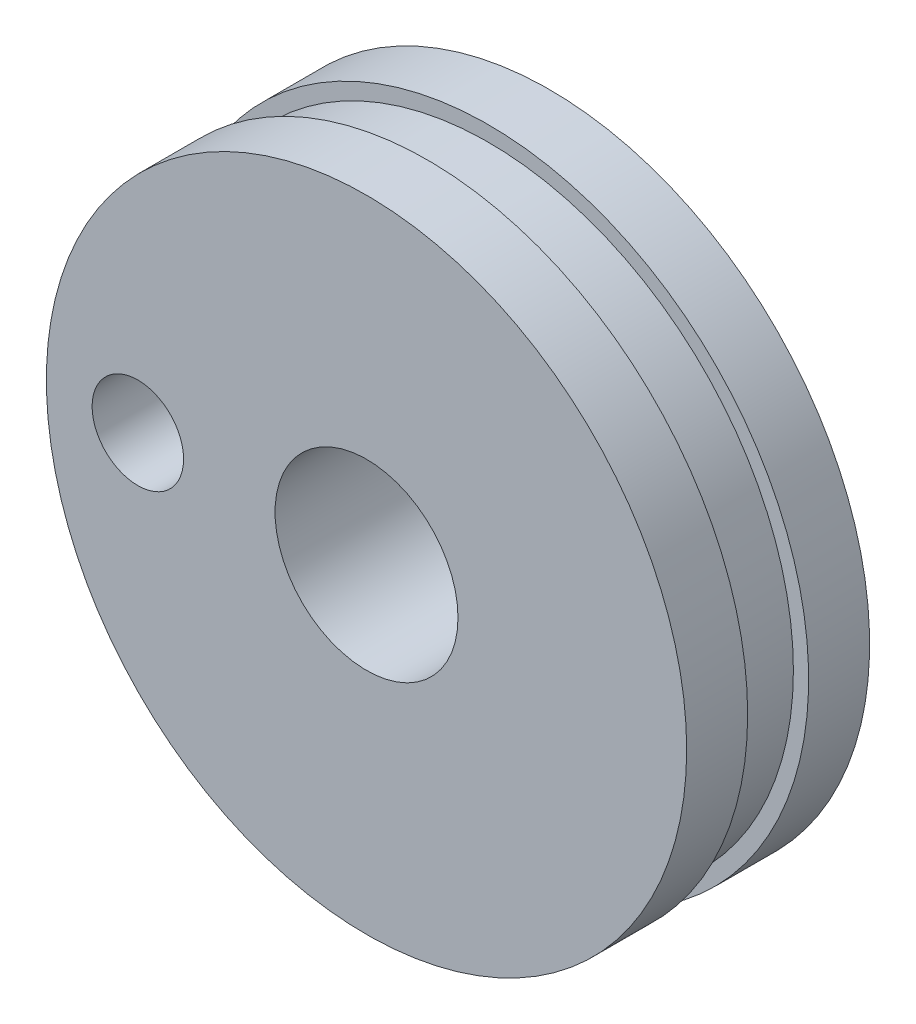
ISO-10303-21;
HEADER;
FILE_DESCRIPTION(('STEP AP214'),'2;1');
FILE_NAME('part.step','',(''),(''),'','','');
FILE_SCHEMA(('AUTOMOTIVE_DESIGN { 1 0 10303 214 1 1 1 1 }'));
ENDSEC;
DATA;
#1=APPLICATION_CONTEXT('core data for automotive mechanical design processes');
#2=APPLICATION_PROTOCOL_DEFINITION('international standard','automotive_design',2000,#1);
#3=PRODUCT_CONTEXT('',#1,'mechanical');
#4=PRODUCT('Part','Part','',(#3));
#5=PRODUCT_RELATED_PRODUCT_CATEGORY('part','',(#4));
#6=PRODUCT_DEFINITION_FORMATION('','',#4);
#7=PRODUCT_DEFINITION_CONTEXT('part definition',#1,'design');
#8=PRODUCT_DEFINITION('design','',#6,#7);
#9=PRODUCT_DEFINITION_SHAPE('','',#8);
#10=(LENGTH_UNIT() NAMED_UNIT(*) SI_UNIT(.MILLI.,.METRE.));
#11=(NAMED_UNIT(*) PLANE_ANGLE_UNIT() SI_UNIT($,.RADIAN.));
#12=(NAMED_UNIT(*) SI_UNIT($,.STERADIAN.) SOLID_ANGLE_UNIT());
#13=UNCERTAINTY_MEASURE_WITH_UNIT(LENGTH_MEASURE(1.E-05),#10,'distance_accuracy_value','');
#14=(GEOMETRIC_REPRESENTATION_CONTEXT(3) GLOBAL_UNCERTAINTY_ASSIGNED_CONTEXT((#13)) GLOBAL_UNIT_ASSIGNED_CONTEXT((#10,
#11,#12)) REPRESENTATION_CONTEXT('',''));
#15=CARTESIAN_POINT('',(0.,0.,0.));
#16=DIRECTION('',(0.,0.,1.));
#17=DIRECTION('',(1.,0.,0.));
#18=AXIS2_PLACEMENT_3D('',#15,#16,#17);
#19=CARTESIAN_POINT('',(0.,0.,14.));
#20=DIRECTION('',(0.,0.,-1.));
#21=DIRECTION('',(-1.,0.,0.));
#22=AXIS2_PLACEMENT_3D('',#19,#20,#21);
#23=CYLINDRICAL_SURFACE('',#22,73.5);
#24=CARTESIAN_POINT('',(0.,0.,14.));
#25=DIRECTION('',(0.,0.,1.));
#26=DIRECTION('',(1.,0.,0.));
#27=AXIS2_PLACEMENT_3D('',#24,#25,#26);
#28=CIRCLE('',#27,73.5);
#29=CARTESIAN_POINT('',(73.5,0.,14.));
#30=VERTEX_POINT('',#29);
#31=EDGE_CURVE('E10',#30,#30,#28,.T.);
#32=ORIENTED_EDGE('',*,*,#31,.F.);
#33=EDGE_LOOP('',(#32));
#34=FACE_BOUND('',#33,.T.);
#35=CARTESIAN_POINT('',(0.,0.,0.));
#36=DIRECTION('',(0.,0.,1.));
#37=DIRECTION('',(1.,0.,0.));
#38=AXIS2_PLACEMENT_3D('',#35,#36,#37);
#39=CIRCLE('',#38,73.5);
#40=CARTESIAN_POINT('',(73.5,0.,0.));
#41=VERTEX_POINT('',#40);
#42=EDGE_CURVE('E45',#41,#41,#39,.T.);
#43=ORIENTED_EDGE('',*,*,#42,.T.);
#44=EDGE_LOOP('',(#43));
#45=FACE_BOUND('',#44,.T.);
#46=ADVANCED_FACE('F37',(#34,#45),#23,.T.);
#47=CARTESIAN_POINT('',(0.,0.,14.));
#48=DIRECTION('',(0.,0.,1.));
#49=DIRECTION('',(1.,0.,0.));
#50=AXIS2_PLACEMENT_3D('',#47,#48,#49);
#51=PLANE('',#50);
#52=CARTESIAN_POINT('',(-52.5,0.,14.));
#53=DIRECTION('',(0.,0.,1.));
#54=DIRECTION('',(1.,0.,0.));
#55=AXIS2_PLACEMENT_3D('',#52,#53,#54);
#56=CIRCLE('',#55,10.5);
#57=CARTESIAN_POINT('',(-42.,0.,14.));
#58=VERTEX_POINT('',#57);
#59=EDGE_CURVE('E72',#58,#58,#56,.T.);
#60=ORIENTED_EDGE('',*,*,#59,.F.);
#61=EDGE_LOOP('',(#60));
#62=FACE_BOUND('',#61,.T.);
#63=CARTESIAN_POINT('',(0.,0.,14.));
#64=DIRECTION('',(0.,0.,1.));
#65=DIRECTION('',(1.,0.,0.));
#66=AXIS2_PLACEMENT_3D('',#63,#64,#65);
#67=CIRCLE('',#66,21.);
#68=CARTESIAN_POINT('',(21.,0.,14.));
#69=VERTEX_POINT('',#68);
#70=EDGE_CURVE('E68',#69,#69,#67,.T.);
#71=ORIENTED_EDGE('',*,*,#70,.F.);
#72=EDGE_LOOP('',(#71));
#73=FACE_BOUND('',#72,.T.);
#74=ORIENTED_EDGE('',*,*,#31,.T.);
#75=EDGE_LOOP('',(#74));
#76=FACE_BOUND('',#75,.T.);
#77=ADVANCED_FACE('F111',(#62,#73,#76),#51,.T.);
#78=CARTESIAN_POINT('',(0.,0.,0.));
#79=DIRECTION('',(0.,0.,1.));
#80=DIRECTION('',(1.,0.,0.));
#81=AXIS2_PLACEMENT_3D('',#78,#79,#80);
#82=PLANE('',#81);
#83=CARTESIAN_POINT('',(0.,0.,0.));
#84=DIRECTION('',(0.,0.,1.));
#85=DIRECTION('',(1.,0.,0.));
#86=AXIS2_PLACEMENT_3D('',#83,#84,#85);
#87=CIRCLE('',#86,70.);
#88=CARTESIAN_POINT('',(70.,0.,0.));
#89=VERTEX_POINT('',#88);
#90=EDGE_CURVE('E51',#89,#89,#87,.T.);
#91=ORIENTED_EDGE('',*,*,#90,.T.);
#92=EDGE_LOOP('',(#91));
#93=FACE_BOUND('',#92,.T.);
#94=ORIENTED_EDGE('',*,*,#42,.F.);
#95=EDGE_LOOP('',(#94));
#96=FACE_BOUND('',#95,.T.);
#97=ADVANCED_FACE('F116',(#93,#96),#82,.F.);
#98=CARTESIAN_POINT('',(0.,0.,-14.));
#99=DIRECTION('',(0.,0.,1.));
#100=DIRECTION('',(1.,0.,0.));
#101=AXIS2_PLACEMENT_3D('',#98,#99,#100);
#102=CYLINDRICAL_SURFACE('',#101,70.);
#103=CARTESIAN_POINT('',(0.,0.,-14.));
#104=DIRECTION('',(0.,0.,1.));
#105=DIRECTION('',(1.,0.,0.));
#106=AXIS2_PLACEMENT_3D('',#103,#104,#105);
#107=CIRCLE('',#106,70.);
#108=CARTESIAN_POINT('',(70.,0.,-14.));
#109=VERTEX_POINT('',#108);
#110=EDGE_CURVE('E56',#109,#109,#107,.T.);
#111=ORIENTED_EDGE('',*,*,#110,.T.);
#112=EDGE_LOOP('',(#111));
#113=FACE_BOUND('',#112,.T.);
#114=ORIENTED_EDGE('',*,*,#90,.F.);
#115=EDGE_LOOP('',(#114));
#116=FACE_BOUND('',#115,.T.);
#117=ADVANCED_FACE('F96',(#113,#116),#102,.T.);
#118=CARTESIAN_POINT('',(0.,0.,-28.));
#119=DIRECTION('',(0.,0.,1.));
#120=DIRECTION('',(1.,0.,0.));
#121=AXIS2_PLACEMENT_3D('',#118,#119,#120);
#122=CYLINDRICAL_SURFACE('',#121,73.5);
#123=CARTESIAN_POINT('',(0.,0.,-28.));
#124=DIRECTION('',(0.,0.,-1.));
#125=DIRECTION('',(-1.,0.,0.));
#126=AXIS2_PLACEMENT_3D('',#123,#124,#125);
#127=CIRCLE('',#126,73.5);
#128=CARTESIAN_POINT('',(-73.5,0.,-28.));
#129=VERTEX_POINT('',#128);
#130=EDGE_CURVE('E60',#129,#129,#127,.T.);
#131=ORIENTED_EDGE('',*,*,#130,.F.);
#132=EDGE_LOOP('',(#131));
#133=FACE_BOUND('',#132,.T.);
#134=CARTESIAN_POINT('',(0.,0.,-14.));
#135=DIRECTION('',(0.,0.,-1.));
#136=DIRECTION('',(-1.,0.,0.));
#137=AXIS2_PLACEMENT_3D('',#134,#135,#136);
#138=CIRCLE('',#137,73.5);
#139=CARTESIAN_POINT('',(-73.5,0.,-14.));
#140=VERTEX_POINT('',#139);
#141=EDGE_CURVE('E61',#140,#140,#138,.T.);
#142=ORIENTED_EDGE('',*,*,#141,.T.);
#143=EDGE_LOOP('',(#142));
#144=FACE_BOUND('',#143,.T.);
#145=ADVANCED_FACE('F87',(#133,#144),#122,.T.);
#146=CARTESIAN_POINT('',(0.,0.,-28.));
#147=DIRECTION('',(0.,0.,-1.));
#148=DIRECTION('',(-1.,0.,0.));
#149=AXIS2_PLACEMENT_3D('',#146,#147,#148);
#150=PLANE('',#149);
#151=CARTESIAN_POINT('',(-52.5,0.,-28.));
#152=DIRECTION('',(0.,0.,-1.));
#153=DIRECTION('',(-1.,0.,0.));
#154=AXIS2_PLACEMENT_3D('',#151,#152,#153);
#155=CIRCLE('',#154,10.5);
#156=CARTESIAN_POINT('',(-63.,0.,-28.));
#157=VERTEX_POINT('',#156);
#158=EDGE_CURVE('E76',#157,#157,#155,.T.);
#159=ORIENTED_EDGE('',*,*,#158,.F.);
#160=EDGE_LOOP('',(#159));
#161=FACE_BOUND('',#160,.T.);
#162=CARTESIAN_POINT('',(0.,0.,-28.));
#163=DIRECTION('',(0.,0.,-1.));
#164=DIRECTION('',(-1.,0.,0.));
#165=AXIS2_PLACEMENT_3D('',#162,#163,#164);
#166=CIRCLE('',#165,21.);
#167=CARTESIAN_POINT('',(-21.,0.,-28.));
#168=VERTEX_POINT('',#167);
#169=EDGE_CURVE('E40',#168,#168,#166,.T.);
#170=ORIENTED_EDGE('',*,*,#169,.F.);
#171=EDGE_LOOP('',(#170));
#172=FACE_BOUND('',#171,.T.);
#173=ORIENTED_EDGE('',*,*,#130,.T.);
#174=EDGE_LOOP('',(#173));
#175=FACE_BOUND('',#174,.T.);
#176=ADVANCED_FACE('F83',(#161,#172,#175),#150,.T.);
#177=CARTESIAN_POINT('',(0.,0.,-14.));
#178=DIRECTION('',(0.,0.,-1.));
#179=DIRECTION('',(-1.,0.,0.));
#180=AXIS2_PLACEMENT_3D('',#177,#178,#179);
#181=PLANE('',#180);
#182=ORIENTED_EDGE('',*,*,#110,.F.);
#183=EDGE_LOOP('',(#182));
#184=FACE_BOUND('',#183,.T.);
#185=ORIENTED_EDGE('',*,*,#141,.F.);
#186=EDGE_LOOP('',(#185));
#187=FACE_BOUND('',#186,.T.);
#188=ADVANCED_FACE('F86',(#184,#187),#181,.F.);
#189=CARTESIAN_POINT('',(0.,0.,-70.));
#190=DIRECTION('',(0.,0.,1.));
#191=DIRECTION('',(1.,0.,0.));
#192=AXIS2_PLACEMENT_3D('',#189,#190,#191);
#193=CYLINDRICAL_SURFACE('',#192,21.);
#194=ORIENTED_EDGE('',*,*,#169,.T.);
#195=EDGE_LOOP('',(#194));
#196=FACE_BOUND('',#195,.T.);
#197=ORIENTED_EDGE('',*,*,#70,.T.);
#198=EDGE_LOOP('',(#197));
#199=FACE_BOUND('',#198,.T.);
#200=ADVANCED_FACE('F101',(#196,#199),#193,.F.);
#201=CARTESIAN_POINT('',(-52.5,0.,56.));
#202=DIRECTION('',(0.,0.,-1.));
#203=DIRECTION('',(-1.,0.,0.));
#204=AXIS2_PLACEMENT_3D('',#201,#202,#203);
#205=CYLINDRICAL_SURFACE('',#204,10.5);
#206=ORIENTED_EDGE('',*,*,#59,.T.);
#207=EDGE_LOOP('',(#206));
#208=FACE_BOUND('',#207,.T.);
#209=ORIENTED_EDGE('',*,*,#158,.T.);
#210=EDGE_LOOP('',(#209));
#211=FACE_BOUND('',#210,.T.);
#212=ADVANCED_FACE('F81',(#208,#211),#205,.F.);
#213=CLOSED_SHELL('',(#46,#77,#97,#117,#145,#176,#188,#200,#212));
#214=MANIFOLD_SOLID_BREP('B2',#213);
#215=ADVANCED_BREP_SHAPE_REPRESENTATION('',(#18,#214),#14);
#216=SHAPE_DEFINITION_REPRESENTATION(#9,#215);
ENDSEC;
END-ISO-10303-21;
